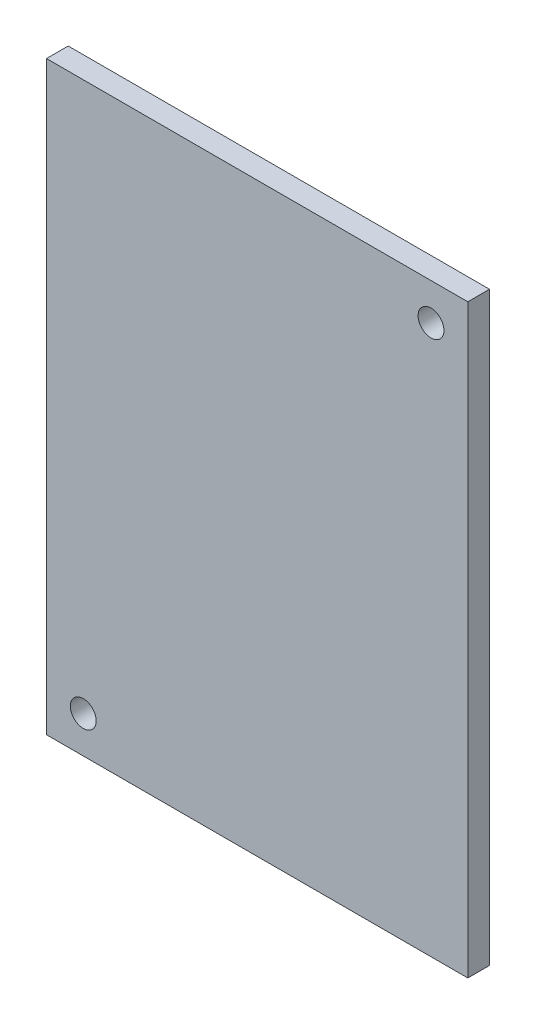
ISO-10303-21;
HEADER;
FILE_DESCRIPTION(('STEP AP214'),'2;1');
FILE_NAME('part.step','',(''),(''),'','','');
FILE_SCHEMA(('AUTOMOTIVE_DESIGN { 1 0 10303 214 1 1 1 1 }'));
ENDSEC;
DATA;
#1=APPLICATION_CONTEXT('core data for automotive mechanical design processes');
#2=APPLICATION_PROTOCOL_DEFINITION('international standard','automotive_design',2000,#1);
#3=PRODUCT_CONTEXT('',#1,'mechanical');
#4=PRODUCT('Part','Part','',(#3));
#5=PRODUCT_RELATED_PRODUCT_CATEGORY('part','',(#4));
#6=PRODUCT_DEFINITION_FORMATION('','',#4);
#7=PRODUCT_DEFINITION_CONTEXT('part definition',#1,'design');
#8=PRODUCT_DEFINITION('design','',#6,#7);
#9=PRODUCT_DEFINITION_SHAPE('','',#8);
#10=(LENGTH_UNIT() NAMED_UNIT(*) SI_UNIT(.MILLI.,.METRE.));
#11=(NAMED_UNIT(*) PLANE_ANGLE_UNIT() SI_UNIT($,.RADIAN.));
#12=(NAMED_UNIT(*) SI_UNIT($,.STERADIAN.) SOLID_ANGLE_UNIT());
#13=UNCERTAINTY_MEASURE_WITH_UNIT(LENGTH_MEASURE(1.E-05),#10,'distance_accuracy_value','');
#14=(GEOMETRIC_REPRESENTATION_CONTEXT(3) GLOBAL_UNCERTAINTY_ASSIGNED_CONTEXT((#13)) GLOBAL_UNIT_ASSIGNED_CONTEXT((#10,
#11,#12)) REPRESENTATION_CONTEXT('',''));
#15=CARTESIAN_POINT('',(0.,0.,0.));
#16=DIRECTION('',(0.,0.,1.));
#17=DIRECTION('',(1.,0.,0.));
#18=AXIS2_PLACEMENT_3D('',#15,#16,#17);
#19=CARTESIAN_POINT('',(29.085,40.43,2.9972));
#20=DIRECTION('',(0.,-1.,0.));
#21=DIRECTION('',(0.,0.,-1.));
#22=AXIS2_PLACEMENT_3D('',#19,#20,#21);
#23=PLANE('',#22);
#24=DIRECTION('',(-1.,0.,0.));
#25=VECTOR('',#24,1.);
#26=CARTESIAN_POINT('',(29.085,40.43,0.));
#27=LINE('',#26,#25);
#28=CARTESIAN_POINT('',(29.085,40.43,0.));
#29=VERTEX_POINT('',#28);
#30=CARTESIAN_POINT('',(-29.085,40.43,0.));
#31=VERTEX_POINT('',#30);
#32=EDGE_CURVE('E113',#29,#31,#27,.T.);
#33=ORIENTED_EDGE('',*,*,#32,.T.);
#34=DIRECTION('',(0.,0.,-1.));
#35=VECTOR('',#34,1.);
#36=CARTESIAN_POINT('',(-29.085,40.43,2.9972));
#37=LINE('',#36,#35);
#38=CARTESIAN_POINT('',(-29.085,40.43,2.9972));
#39=VERTEX_POINT('',#38);
#40=EDGE_CURVE('E11',#39,#31,#37,.T.);
#41=ORIENTED_EDGE('',*,*,#40,.F.);
#42=DIRECTION('',(-1.,0.,0.));
#43=VECTOR('',#42,1.);
#44=CARTESIAN_POINT('',(29.085,40.43,2.9972));
#45=LINE('',#44,#43);
#46=CARTESIAN_POINT('',(29.085,40.43,2.9972));
#47=VERTEX_POINT('',#46);
#48=EDGE_CURVE('E97',#47,#39,#45,.T.);
#49=ORIENTED_EDGE('',*,*,#48,.F.);
#50=DIRECTION('',(0.,0.,-1.));
#51=VECTOR('',#50,1.);
#52=CARTESIAN_POINT('',(29.085,40.43,2.9972));
#53=LINE('',#52,#51);
#54=EDGE_CURVE('E109',#47,#29,#53,.T.);
#55=ORIENTED_EDGE('',*,*,#54,.T.);
#56=EDGE_LOOP('',(#33,#41,#49,#55));
#57=FACE_BOUND('',#56,.T.);
#58=ADVANCED_FACE('F45',(#57),#23,.F.);
#59=CARTESIAN_POINT('',(-29.085,-40.43,2.9972));
#60=DIRECTION('',(1.,0.,0.));
#61=DIRECTION('',(0.,0.,-1.));
#62=AXIS2_PLACEMENT_3D('',#59,#60,#61);
#63=PLANE('',#62);
#64=DIRECTION('',(0.,-1.,0.));
#65=VECTOR('',#64,1.);
#66=CARTESIAN_POINT('',(-29.085,-40.43,0.));
#67=LINE('',#66,#65);
#68=CARTESIAN_POINT('',(-29.085,-40.43,0.));
#69=VERTEX_POINT('',#68);
#70=EDGE_CURVE('E102',#31,#69,#67,.T.);
#71=ORIENTED_EDGE('',*,*,#70,.T.);
#72=DIRECTION('',(0.,0.,-1.));
#73=VECTOR('',#72,1.);
#74=CARTESIAN_POINT('',(-29.085,-40.43,2.9972));
#75=LINE('',#74,#73);
#76=CARTESIAN_POINT('',(-29.085,-40.43,2.9972));
#77=VERTEX_POINT('',#76);
#78=EDGE_CURVE('E54',#77,#69,#75,.T.);
#79=ORIENTED_EDGE('',*,*,#78,.F.);
#80=DIRECTION('',(0.,-1.,0.));
#81=VECTOR('',#80,1.);
#82=CARTESIAN_POINT('',(-29.085,-40.43,2.9972));
#83=LINE('',#82,#81);
#84=EDGE_CURVE('E92',#39,#77,#83,.T.);
#85=ORIENTED_EDGE('',*,*,#84,.F.);
#86=ORIENTED_EDGE('',*,*,#40,.T.);
#87=EDGE_LOOP('',(#71,#79,#85,#86));
#88=FACE_BOUND('',#87,.T.);
#89=ADVANCED_FACE('F101',(#88),#63,.F.);
#90=CARTESIAN_POINT('',(29.085,-40.43,2.9972));
#91=DIRECTION('',(0.,1.,0.));
#92=DIRECTION('',(0.,0.,1.));
#93=AXIS2_PLACEMENT_3D('',#90,#91,#92);
#94=PLANE('',#93);
#95=DIRECTION('',(1.,0.,0.));
#96=VECTOR('',#95,1.);
#97=CARTESIAN_POINT('',(29.085,-40.43,0.));
#98=LINE('',#97,#96);
#99=CARTESIAN_POINT('',(29.085,-40.43,0.));
#100=VERTEX_POINT('',#99);
#101=EDGE_CURVE('E79',#69,#100,#98,.T.);
#102=ORIENTED_EDGE('',*,*,#101,.T.);
#103=DIRECTION('',(0.,0.,-1.));
#104=VECTOR('',#103,1.);
#105=CARTESIAN_POINT('',(29.085,-40.43,2.9972));
#106=LINE('',#105,#104);
#107=CARTESIAN_POINT('',(29.085,-40.43,2.9972));
#108=VERTEX_POINT('',#107);
#109=EDGE_CURVE('E104',#108,#100,#106,.T.);
#110=ORIENTED_EDGE('',*,*,#109,.F.);
#111=DIRECTION('',(1.,0.,0.));
#112=VECTOR('',#111,1.);
#113=CARTESIAN_POINT('',(29.085,-40.43,2.9972));
#114=LINE('',#113,#112);
#115=EDGE_CURVE('E95',#77,#108,#114,.T.);
#116=ORIENTED_EDGE('',*,*,#115,.F.);
#117=ORIENTED_EDGE('',*,*,#78,.T.);
#118=EDGE_LOOP('',(#102,#110,#116,#117));
#119=FACE_BOUND('',#118,.T.);
#120=ADVANCED_FACE('F105',(#119),#94,.F.);
#121=CARTESIAN_POINT('',(29.085,-40.43,2.9972));
#122=DIRECTION('',(-1.,0.,0.));
#123=DIRECTION('',(0.,0.,1.));
#124=AXIS2_PLACEMENT_3D('',#121,#122,#123);
#125=PLANE('',#124);
#126=DIRECTION('',(0.,1.,0.));
#127=VECTOR('',#126,1.);
#128=CARTESIAN_POINT('',(29.085,-40.43,0.));
#129=LINE('',#128,#127);
#130=EDGE_CURVE('E85',#100,#29,#129,.T.);
#131=ORIENTED_EDGE('',*,*,#130,.T.);
#132=ORIENTED_EDGE('',*,*,#54,.F.);
#133=DIRECTION('',(0.,1.,0.));
#134=VECTOR('',#133,1.);
#135=CARTESIAN_POINT('',(29.085,-40.43,2.9972));
#136=LINE('',#135,#134);
#137=EDGE_CURVE('E62',#108,#47,#136,.T.);
#138=ORIENTED_EDGE('',*,*,#137,.F.);
#139=ORIENTED_EDGE('',*,*,#109,.T.);
#140=EDGE_LOOP('',(#131,#132,#138,#139));
#141=FACE_BOUND('',#140,.T.);
#142=ADVANCED_FACE('F127',(#141),#125,.F.);
#143=CARTESIAN_POINT('',(0.,0.,2.9972));
#144=DIRECTION('',(0.,0.,-1.));
#145=DIRECTION('',(-1.,0.,0.));
#146=AXIS2_PLACEMENT_3D('',#143,#144,#145);
#147=PLANE('',#146);
#148=CARTESIAN_POINT('',(24.005,35.35,2.9972));
#149=DIRECTION('',(0.,0.,1.));
#150=DIRECTION('',(1.,0.,0.));
#151=AXIS2_PLACEMENT_3D('',#148,#149,#150);
#152=CIRCLE('',#151,1.786001);
#153=CARTESIAN_POINT('',(25.791001,35.35,2.9972));
#154=VERTEX_POINT('',#153);
#155=EDGE_CURVE('E145',#154,#154,#152,.T.);
#156=ORIENTED_EDGE('',*,*,#155,.F.);
#157=EDGE_LOOP('',(#156));
#158=FACE_BOUND('',#157,.T.);
#159=CARTESIAN_POINT('',(-24.005,-35.35,2.9972));
#160=DIRECTION('',(0.,0.,1.));
#161=DIRECTION('',(1.,0.,0.));
#162=AXIS2_PLACEMENT_3D('',#159,#160,#161);
#163=CIRCLE('',#162,1.786001);
#164=CARTESIAN_POINT('',(-22.218999,-35.35,2.9972));
#165=VERTEX_POINT('',#164);
#166=EDGE_CURVE('E137',#165,#165,#163,.T.);
#167=ORIENTED_EDGE('',*,*,#166,.F.);
#168=EDGE_LOOP('',(#167));
#169=FACE_BOUND('',#168,.T.);
#170=ORIENTED_EDGE('',*,*,#48,.T.);
#171=ORIENTED_EDGE('',*,*,#84,.T.);
#172=ORIENTED_EDGE('',*,*,#115,.T.);
#173=ORIENTED_EDGE('',*,*,#137,.T.);
#174=EDGE_LOOP('',(#170,#171,#172,#173));
#175=FACE_BOUND('',#174,.T.);
#176=ADVANCED_FACE('F93',(#158,#169,#175),#147,.F.);
#177=CARTESIAN_POINT('',(0.,0.,0.));
#178=DIRECTION('',(0.,0.,-1.));
#179=DIRECTION('',(-1.,0.,0.));
#180=AXIS2_PLACEMENT_3D('',#177,#178,#179);
#181=PLANE('',#180);
#182=CARTESIAN_POINT('',(24.005,35.35,0.));
#183=DIRECTION('',(0.,0.,1.));
#184=DIRECTION('',(1.,0.,0.));
#185=AXIS2_PLACEMENT_3D('',#182,#183,#184);
#186=CIRCLE('',#185,1.786001);
#187=CARTESIAN_POINT('',(25.791001,35.35,0.));
#188=VERTEX_POINT('',#187);
#189=EDGE_CURVE('E141',#188,#188,#186,.T.);
#190=ORIENTED_EDGE('',*,*,#189,.T.);
#191=EDGE_LOOP('',(#190));
#192=FACE_BOUND('',#191,.T.);
#193=CARTESIAN_POINT('',(-24.005,-35.35,0.));
#194=DIRECTION('',(0.,0.,1.));
#195=DIRECTION('',(1.,0.,0.));
#196=AXIS2_PLACEMENT_3D('',#193,#194,#195);
#197=CIRCLE('',#196,1.786001);
#198=CARTESIAN_POINT('',(-22.218999,-35.35,0.));
#199=VERTEX_POINT('',#198);
#200=EDGE_CURVE('E117',#199,#199,#197,.T.);
#201=ORIENTED_EDGE('',*,*,#200,.T.);
#202=EDGE_LOOP('',(#201));
#203=FACE_BOUND('',#202,.T.);
#204=ORIENTED_EDGE('',*,*,#32,.F.);
#205=ORIENTED_EDGE('',*,*,#130,.F.);
#206=ORIENTED_EDGE('',*,*,#101,.F.);
#207=ORIENTED_EDGE('',*,*,#70,.F.);
#208=EDGE_LOOP('',(#204,#205,#206,#207));
#209=FACE_BOUND('',#208,.T.);
#210=ADVANCED_FACE('F130',(#192,#203,#209),#181,.T.);
#211=CARTESIAN_POINT('',(-24.005,-35.35,2.9972));
#212=DIRECTION('',(0.,0.,1.));
#213=DIRECTION('',(1.,0.,0.));
#214=AXIS2_PLACEMENT_3D('',#211,#212,#213);
#215=CYLINDRICAL_SURFACE('',#214,1.786001);
#216=ORIENTED_EDGE('',*,*,#200,.F.);
#217=EDGE_LOOP('',(#216));
#218=FACE_BOUND('',#217,.T.);
#219=ORIENTED_EDGE('',*,*,#166,.T.);
#220=EDGE_LOOP('',(#219));
#221=FACE_BOUND('',#220,.T.);
#222=ADVANCED_FACE('F157',(#218,#221),#215,.F.);
#223=CARTESIAN_POINT('',(24.005,35.35,2.9972));
#224=DIRECTION('',(0.,0.,1.));
#225=DIRECTION('',(1.,0.,0.));
#226=AXIS2_PLACEMENT_3D('',#223,#224,#225);
#227=CYLINDRICAL_SURFACE('',#226,1.786001);
#228=ORIENTED_EDGE('',*,*,#189,.F.);
#229=EDGE_LOOP('',(#228));
#230=FACE_BOUND('',#229,.T.);
#231=ORIENTED_EDGE('',*,*,#155,.T.);
#232=EDGE_LOOP('',(#231));
#233=FACE_BOUND('',#232,.T.);
#234=ADVANCED_FACE('F150',(#230,#233),#227,.F.);
#235=CLOSED_SHELL('',(#58,#89,#120,#142,#176,#210,#222,#234));
#236=MANIFOLD_SOLID_BREP('B2',#235);
#237=ADVANCED_BREP_SHAPE_REPRESENTATION('',(#18,#236),#14);
#238=SHAPE_DEFINITION_REPRESENTATION(#9,#237);
ENDSEC;
END-ISO-10303-21;
